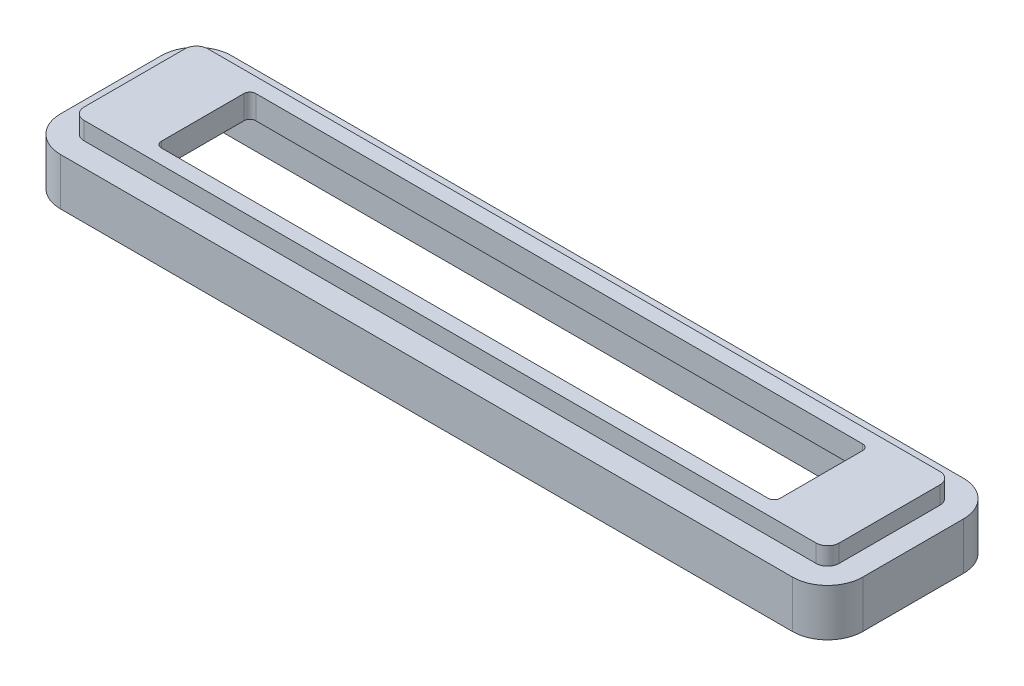
ISO-10303-21;
HEADER;
FILE_DESCRIPTION(('STEP AP214'),'2;1');
FILE_NAME('part.step','',(''),(''),'','','');
FILE_SCHEMA(('AUTOMOTIVE_DESIGN { 1 0 10303 214 1 1 1 1 }'));
ENDSEC;
DATA;
#1=APPLICATION_CONTEXT('core data for automotive mechanical design processes');
#2=APPLICATION_PROTOCOL_DEFINITION('international standard','automotive_design',2000,#1);
#3=PRODUCT_CONTEXT('',#1,'mechanical');
#4=PRODUCT('Part','Part','',(#3));
#5=PRODUCT_RELATED_PRODUCT_CATEGORY('part','',(#4));
#6=PRODUCT_DEFINITION_FORMATION('','',#4);
#7=PRODUCT_DEFINITION_CONTEXT('part definition',#1,'design');
#8=PRODUCT_DEFINITION('design','',#6,#7);
#9=PRODUCT_DEFINITION_SHAPE('','',#8);
#10=(LENGTH_UNIT() NAMED_UNIT(*) SI_UNIT(.MILLI.,.METRE.));
#11=(NAMED_UNIT(*) PLANE_ANGLE_UNIT() SI_UNIT($,.RADIAN.));
#12=(NAMED_UNIT(*) SI_UNIT($,.STERADIAN.) SOLID_ANGLE_UNIT());
#13=UNCERTAINTY_MEASURE_WITH_UNIT(LENGTH_MEASURE(1.E-05),#10,'distance_accuracy_value','');
#14=(GEOMETRIC_REPRESENTATION_CONTEXT(3) GLOBAL_UNCERTAINTY_ASSIGNED_CONTEXT((#13)) GLOBAL_UNIT_ASSIGNED_CONTEXT((#10,
#11,#12)) REPRESENTATION_CONTEXT('',''));
#15=CARTESIAN_POINT('',(0.,0.,0.));
#16=DIRECTION('',(0.,0.,1.));
#17=DIRECTION('',(1.,0.,0.));
#18=AXIS2_PLACEMENT_3D('',#15,#16,#17);
#19=CARTESIAN_POINT('',(31.0185424735563,2.,4.26854247355629));
#20=DIRECTION('',(0.,1.,0.));
#21=DIRECTION('',(0.,0.,1.));
#22=AXIS2_PLACEMENT_3D('',#19,#20,#21);
#23=PLANE('',#22);
#24=CARTESIAN_POINT('',(31.0185424735563,2.,4.26854247355629));
#25=DIRECTION('',(0.,1.,0.));
#26=DIRECTION('',(0.,0.,1.));
#27=AXIS2_PLACEMENT_3D('',#24,#25,#26);
#28=CIRCLE('',#27,0.981457526443713);
#29=CARTESIAN_POINT('',(31.0185424735563,2.,5.25));
#30=VERTEX_POINT('',#29);
#31=CARTESIAN_POINT('',(32.,2.,4.26854247355628));
#32=VERTEX_POINT('',#31);
#33=EDGE_CURVE('E448',#30,#32,#28,.T.);
#34=ORIENTED_EDGE('',*,*,#33,.T.);
#35=DIRECTION('',(0.,0.,-1.));
#36=VECTOR('',#35,1.);
#37=CARTESIAN_POINT('',(32.,2.,4.26854247355628));
#38=LINE('',#37,#36);
#39=CARTESIAN_POINT('',(32.,2.,-4.26854247355628));
#40=VERTEX_POINT('',#39);
#41=EDGE_CURVE('E451',#32,#40,#38,.T.);
#42=ORIENTED_EDGE('',*,*,#41,.T.);
#43=CARTESIAN_POINT('',(31.0185424735563,2.,-4.26854247355629));
#44=DIRECTION('',(0.,1.,0.));
#45=DIRECTION('',(0.,0.,1.));
#46=AXIS2_PLACEMENT_3D('',#43,#44,#45);
#47=CIRCLE('',#46,0.981457526443713);
#48=CARTESIAN_POINT('',(31.0185424735563,2.,-5.25));
#49=VERTEX_POINT('',#48);
#50=EDGE_CURVE('E454',#40,#49,#47,.T.);
#51=ORIENTED_EDGE('',*,*,#50,.T.);
#52=DIRECTION('',(-1.,0.,0.));
#53=VECTOR('',#52,1.);
#54=CARTESIAN_POINT('',(-31.0185424735563,2.,-5.25));
#55=LINE('',#54,#53);
#56=CARTESIAN_POINT('',(-31.0185424735563,2.,-5.25));
#57=VERTEX_POINT('',#56);
#58=EDGE_CURVE('E456',#49,#57,#55,.T.);
#59=ORIENTED_EDGE('',*,*,#58,.T.);
#60=CARTESIAN_POINT('',(-31.0185424735563,2.,-4.26854247355629));
#61=DIRECTION('',(0.,1.,0.));
#62=DIRECTION('',(0.,0.,-1.));
#63=AXIS2_PLACEMENT_3D('',#60,#61,#62);
#64=CIRCLE('',#63,0.981457526443713);
#65=CARTESIAN_POINT('',(-32.,2.,-4.26854247355628));
#66=VERTEX_POINT('',#65);
#67=EDGE_CURVE('E458',#57,#66,#64,.T.);
#68=ORIENTED_EDGE('',*,*,#67,.T.);
#69=DIRECTION('',(0.,0.,1.));
#70=VECTOR('',#69,1.);
#71=CARTESIAN_POINT('',(-32.,2.,4.26854247355628));
#72=LINE('',#71,#70);
#73=CARTESIAN_POINT('',(-32.,2.,4.26854247355628));
#74=VERTEX_POINT('',#73);
#75=EDGE_CURVE('E460',#66,#74,#72,.T.);
#76=ORIENTED_EDGE('',*,*,#75,.T.);
#77=CARTESIAN_POINT('',(-31.0185424735563,2.,4.26854247355629));
#78=DIRECTION('',(0.,1.,0.));
#79=DIRECTION('',(0.,0.,-1.));
#80=AXIS2_PLACEMENT_3D('',#77,#78,#79);
#81=CIRCLE('',#80,0.981457526443713);
#82=CARTESIAN_POINT('',(-31.0185424735563,2.,5.25));
#83=VERTEX_POINT('',#82);
#84=EDGE_CURVE('E462',#74,#83,#81,.T.);
#85=ORIENTED_EDGE('',*,*,#84,.T.);
#86=DIRECTION('',(1.,0.,0.));
#87=VECTOR('',#86,1.);
#88=CARTESIAN_POINT('',(-31.0185424735563,2.,5.25));
#89=LINE('',#88,#87);
#90=EDGE_CURVE('E464',#83,#30,#89,.T.);
#91=ORIENTED_EDGE('',*,*,#90,.T.);
#92=EDGE_LOOP('',(#34,#42,#51,#59,#68,#76,#85,#91));
#93=FACE_BOUND('',#92,.T.);
#94=DIRECTION('',(0.,0.,-1.));
#95=VECTOR('',#94,1.);
#96=CARTESIAN_POINT('',(26.215,2.,-3.50000032024923));
#97=LINE('',#96,#95);
#98=CARTESIAN_POINT('',(26.215,2.,3.50000032024923));
#99=VERTEX_POINT('',#98);
#100=CARTESIAN_POINT('',(26.215,2.,-3.50000032024923));
#101=VERTEX_POINT('',#100);
#102=EDGE_CURVE('E394',#99,#101,#97,.T.);
#103=ORIENTED_EDGE('',*,*,#102,.F.);
#104=CARTESIAN_POINT('',(25.715,2.,3.50000032024924));
#105=DIRECTION('',(0.,1.,0.));
#106=DIRECTION('',(0.,0.,1.));
#107=AXIS2_PLACEMENT_3D('',#104,#105,#106);
#108=CIRCLE('',#107,0.5);
#109=CARTESIAN_POINT('',(25.715,2.,4.00000032024924));
#110=VERTEX_POINT('',#109);
#111=EDGE_CURVE('E392',#110,#99,#108,.T.);
#112=ORIENTED_EDGE('',*,*,#111,.F.);
#113=DIRECTION('',(1.,0.,0.));
#114=VECTOR('',#113,1.);
#115=CARTESIAN_POINT('',(-25.715,2.,4.00000032024924));
#116=LINE('',#115,#114);
#117=CARTESIAN_POINT('',(-25.715,2.,4.00000032024924));
#118=VERTEX_POINT('',#117);
#119=EDGE_CURVE('E407',#118,#110,#116,.T.);
#120=ORIENTED_EDGE('',*,*,#119,.F.);
#121=CARTESIAN_POINT('',(-25.715,2.,3.50000032024924));
#122=DIRECTION('',(0.,1.,0.));
#123=DIRECTION('',(0.,0.,1.));
#124=AXIS2_PLACEMENT_3D('',#121,#122,#123);
#125=CIRCLE('',#124,0.5);
#126=CARTESIAN_POINT('',(-26.215,2.,3.50000032024923));
#127=VERTEX_POINT('',#126);
#128=EDGE_CURVE('E405',#127,#118,#125,.T.);
#129=ORIENTED_EDGE('',*,*,#128,.F.);
#130=DIRECTION('',(0.,0.,1.));
#131=VECTOR('',#130,1.);
#132=CARTESIAN_POINT('',(-26.215,2.,-3.50000032024923));
#133=LINE('',#132,#131);
#134=CARTESIAN_POINT('',(-26.215,2.,-3.50000032024923));
#135=VERTEX_POINT('',#134);
#136=EDGE_CURVE('E403',#135,#127,#133,.T.);
#137=ORIENTED_EDGE('',*,*,#136,.F.);
#138=CARTESIAN_POINT('',(-25.715,2.,-3.50000032024924));
#139=DIRECTION('',(0.,1.,0.));
#140=DIRECTION('',(0.,0.,-1.));
#141=AXIS2_PLACEMENT_3D('',#138,#139,#140);
#142=CIRCLE('',#141,0.5);
#143=CARTESIAN_POINT('',(-25.715,2.,-4.00000032024924));
#144=VERTEX_POINT('',#143);
#145=EDGE_CURVE('E401',#144,#135,#142,.T.);
#146=ORIENTED_EDGE('',*,*,#145,.F.);
#147=DIRECTION('',(-1.,0.,0.));
#148=VECTOR('',#147,1.);
#149=CARTESIAN_POINT('',(-25.715,2.,-4.00000032024924));
#150=LINE('',#149,#148);
#151=CARTESIAN_POINT('',(25.715,2.,-4.00000032024924));
#152=VERTEX_POINT('',#151);
#153=EDGE_CURVE('E399',#152,#144,#150,.T.);
#154=ORIENTED_EDGE('',*,*,#153,.F.);
#155=CARTESIAN_POINT('',(25.715,2.,-3.50000032024924));
#156=DIRECTION('',(0.,1.,0.));
#157=DIRECTION('',(0.,0.,1.));
#158=AXIS2_PLACEMENT_3D('',#155,#156,#157);
#159=CIRCLE('',#158,0.5);
#160=EDGE_CURVE('E397',#101,#152,#159,.T.);
#161=ORIENTED_EDGE('',*,*,#160,.F.);
#162=EDGE_LOOP('',(#103,#112,#120,#129,#137,#146,#154,#161));
#163=FACE_BOUND('',#162,.T.);
#164=ADVANCED_FACE('F37',(#93,#163),#23,.T.);
#165=CARTESIAN_POINT('',(31.0185424735563,0.,4.26854247355629));
#166=DIRECTION('',(0.,1.,0.));
#167=DIRECTION('',(0.,0.,1.));
#168=AXIS2_PLACEMENT_3D('',#165,#166,#167);
#169=PLANE('',#168);
#170=CARTESIAN_POINT('',(31.0185424735563,0.,4.26854247355629));
#171=DIRECTION('',(0.,1.,0.));
#172=DIRECTION('',(0.,0.,1.));
#173=AXIS2_PLACEMENT_3D('',#170,#171,#172);
#174=CIRCLE('',#173,0.981457526443713);
#175=CARTESIAN_POINT('',(31.0185424735563,0.,5.25));
#176=VERTEX_POINT('',#175);
#177=CARTESIAN_POINT('',(32.,0.,4.26854247355628));
#178=VERTEX_POINT('',#177);
#179=EDGE_CURVE('E254',#176,#178,#174,.T.);
#180=ORIENTED_EDGE('',*,*,#179,.F.);
#181=DIRECTION('',(1.,0.,0.));
#182=VECTOR('',#181,1.);
#183=CARTESIAN_POINT('',(-31.0185424735563,0.,5.25));
#184=LINE('',#183,#182);
#185=CARTESIAN_POINT('',(-31.0185424735563,0.,5.25));
#186=VERTEX_POINT('',#185);
#187=EDGE_CURVE('E452',#186,#176,#184,.T.);
#188=ORIENTED_EDGE('',*,*,#187,.F.);
#189=CARTESIAN_POINT('',(-31.0185424735563,0.,4.26854247355629));
#190=DIRECTION('',(0.,1.,0.));
#191=DIRECTION('',(0.,0.,-1.));
#192=AXIS2_PLACEMENT_3D('',#189,#190,#191);
#193=CIRCLE('',#192,0.981457526443713);
#194=CARTESIAN_POINT('',(-32.,0.,4.26854247355628));
#195=VERTEX_POINT('',#194);
#196=EDGE_CURVE('E482',#195,#186,#193,.T.);
#197=ORIENTED_EDGE('',*,*,#196,.F.);
#198=DIRECTION('',(0.,0.,1.));
#199=VECTOR('',#198,1.);
#200=CARTESIAN_POINT('',(-32.,0.,4.26854247355628));
#201=LINE('',#200,#199);
#202=CARTESIAN_POINT('',(-32.,0.,-4.26854247355628));
#203=VERTEX_POINT('',#202);
#204=EDGE_CURVE('E479',#203,#195,#201,.T.);
#205=ORIENTED_EDGE('',*,*,#204,.F.);
#206=CARTESIAN_POINT('',(-31.0185424735563,0.,-4.26854247355629));
#207=DIRECTION('',(0.,1.,0.));
#208=DIRECTION('',(0.,0.,-1.));
#209=AXIS2_PLACEMENT_3D('',#206,#207,#208);
#210=CIRCLE('',#209,0.981457526443713);
#211=CARTESIAN_POINT('',(-31.0185424735563,0.,-5.25));
#212=VERTEX_POINT('',#211);
#213=EDGE_CURVE('E476',#212,#203,#210,.T.);
#214=ORIENTED_EDGE('',*,*,#213,.F.);
#215=DIRECTION('',(-1.,0.,0.));
#216=VECTOR('',#215,1.);
#217=CARTESIAN_POINT('',(-31.0185424735563,0.,-5.25));
#218=LINE('',#217,#216);
#219=CARTESIAN_POINT('',(31.0185424735563,0.,-5.25));
#220=VERTEX_POINT('',#219);
#221=EDGE_CURVE('E473',#220,#212,#218,.T.);
#222=ORIENTED_EDGE('',*,*,#221,.F.);
#223=CARTESIAN_POINT('',(31.0185424735563,0.,-4.26854247355629));
#224=DIRECTION('',(0.,1.,0.));
#225=DIRECTION('',(0.,0.,1.));
#226=AXIS2_PLACEMENT_3D('',#223,#224,#225);
#227=CIRCLE('',#226,0.981457526443713);
#228=CARTESIAN_POINT('',(32.,0.,-4.26854247355628));
#229=VERTEX_POINT('',#228);
#230=EDGE_CURVE('E470',#229,#220,#227,.T.);
#231=ORIENTED_EDGE('',*,*,#230,.F.);
#232=DIRECTION('',(0.,0.,-1.));
#233=VECTOR('',#232,1.);
#234=CARTESIAN_POINT('',(32.,0.,4.26854247355628));
#235=LINE('',#234,#233);
#236=EDGE_CURVE('E468',#178,#229,#235,.T.);
#237=ORIENTED_EDGE('',*,*,#236,.F.);
#238=EDGE_LOOP('',(#180,#188,#197,#205,#214,#222,#231,#237));
#239=FACE_BOUND('',#238,.T.);
#240=CARTESIAN_POINT('',(25.715,0.,3.50000032024924));
#241=DIRECTION('',(0.,1.,0.));
#242=DIRECTION('',(0.,0.,1.));
#243=AXIS2_PLACEMENT_3D('',#240,#241,#242);
#244=CIRCLE('',#243,0.5);
#245=CARTESIAN_POINT('',(25.715,0.,4.00000032024924));
#246=VERTEX_POINT('',#245);
#247=CARTESIAN_POINT('',(26.215,0.,3.50000032024923));
#248=VERTEX_POINT('',#247);
#249=EDGE_CURVE('E378',#246,#248,#244,.T.);
#250=ORIENTED_EDGE('',*,*,#249,.T.);
#251=DIRECTION('',(0.,0.,-1.));
#252=VECTOR('',#251,1.);
#253=CARTESIAN_POINT('',(26.215,0.,-3.50000032024923));
#254=LINE('',#253,#252);
#255=CARTESIAN_POINT('',(26.215,0.,-3.50000032024923));
#256=VERTEX_POINT('',#255);
#257=EDGE_CURVE('E412',#248,#256,#254,.T.);
#258=ORIENTED_EDGE('',*,*,#257,.T.);
#259=CARTESIAN_POINT('',(25.715,0.,-3.50000032024924));
#260=DIRECTION('',(0.,1.,0.));
#261=DIRECTION('',(0.,0.,1.));
#262=AXIS2_PLACEMENT_3D('',#259,#260,#261);
#263=CIRCLE('',#262,0.5);
#264=CARTESIAN_POINT('',(25.715,0.,-4.00000032024924));
#265=VERTEX_POINT('',#264);
#266=EDGE_CURVE('E415',#256,#265,#263,.T.);
#267=ORIENTED_EDGE('',*,*,#266,.T.);
#268=DIRECTION('',(-1.,0.,0.));
#269=VECTOR('',#268,1.);
#270=CARTESIAN_POINT('',(-25.715,0.,-4.00000032024924));
#271=LINE('',#270,#269);
#272=CARTESIAN_POINT('',(-25.715,0.,-4.00000032024924));
#273=VERTEX_POINT('',#272);
#274=EDGE_CURVE('E418',#265,#273,#271,.T.);
#275=ORIENTED_EDGE('',*,*,#274,.T.);
#276=CARTESIAN_POINT('',(-25.715,0.,-3.50000032024924));
#277=DIRECTION('',(0.,1.,0.));
#278=DIRECTION('',(0.,0.,-1.));
#279=AXIS2_PLACEMENT_3D('',#276,#277,#278);
#280=CIRCLE('',#279,0.5);
#281=CARTESIAN_POINT('',(-26.215,0.,-3.50000032024923));
#282=VERTEX_POINT('',#281);
#283=EDGE_CURVE('E421',#273,#282,#280,.T.);
#284=ORIENTED_EDGE('',*,*,#283,.T.);
#285=DIRECTION('',(0.,0.,1.));
#286=VECTOR('',#285,1.);
#287=CARTESIAN_POINT('',(-26.215,0.,-3.50000032024923));
#288=LINE('',#287,#286);
#289=CARTESIAN_POINT('',(-26.215,0.,3.50000032024923));
#290=VERTEX_POINT('',#289);
#291=EDGE_CURVE('E424',#282,#290,#288,.T.);
#292=ORIENTED_EDGE('',*,*,#291,.T.);
#293=CARTESIAN_POINT('',(-25.715,0.,3.50000032024924));
#294=DIRECTION('',(0.,1.,0.));
#295=DIRECTION('',(0.,0.,1.));
#296=AXIS2_PLACEMENT_3D('',#293,#294,#295);
#297=CIRCLE('',#296,0.5);
#298=CARTESIAN_POINT('',(-25.715,0.,4.00000032024924));
#299=VERTEX_POINT('',#298);
#300=EDGE_CURVE('E427',#290,#299,#297,.T.);
#301=ORIENTED_EDGE('',*,*,#300,.T.);
#302=DIRECTION('',(1.,0.,0.));
#303=VECTOR('',#302,1.);
#304=CARTESIAN_POINT('',(-25.715,0.,4.00000032024924));
#305=LINE('',#304,#303);
#306=EDGE_CURVE('E395',#299,#246,#305,.T.);
#307=ORIENTED_EDGE('',*,*,#306,.T.);
#308=EDGE_LOOP('',(#250,#258,#267,#275,#284,#292,#301,#307));
#309=FACE_BOUND('',#308,.T.);
#310=ADVANCED_FACE('F539',(#239,#309),#169,.F.);
#311=CARTESIAN_POINT('',(31.0185424735563,2.,4.26854247355629));
#312=DIRECTION('',(0.,-1.,0.));
#313=DIRECTION('',(0.,0.,-1.));
#314=AXIS2_PLACEMENT_3D('',#311,#312,#313);
#315=CYLINDRICAL_SURFACE('',#314,0.981457526443713);
#316=DIRECTION('',(0.,-1.,0.));
#317=VECTOR('',#316,1.);
#318=CARTESIAN_POINT('',(31.0185424735563,2.,5.25));
#319=LINE('',#318,#317);
#320=CARTESIAN_POINT('',(31.0185424735563,0.5,5.25));
#321=VERTEX_POINT('',#320);
#322=EDGE_CURVE('E466',#30,#321,#319,.T.);
#323=ORIENTED_EDGE('',*,*,#322,.T.);
#324=CARTESIAN_POINT('',(31.0185424735563,0.5,4.26854247355629));
#325=DIRECTION('',(0.,1.,0.));
#326=DIRECTION('',(0.,0.,1.));
#327=AXIS2_PLACEMENT_3D('',#324,#325,#326);
#328=CIRCLE('',#327,0.981457526443713);
#329=CARTESIAN_POINT('',(32.,0.5,4.26854247355629));
#330=VERTEX_POINT('',#329);
#331=EDGE_CURVE('E52',#321,#330,#328,.T.);
#332=ORIENTED_EDGE('',*,*,#331,.T.);
#333=DIRECTION('',(0.,-1.,0.));
#334=VECTOR('',#333,1.);
#335=CARTESIAN_POINT('',(32.,2.,4.26854247355628));
#336=LINE('',#335,#334);
#337=EDGE_CURVE('E11',#32,#330,#336,.T.);
#338=ORIENTED_EDGE('',*,*,#337,.F.);
#339=ORIENTED_EDGE('',*,*,#33,.F.);
#340=EDGE_LOOP('',(#323,#332,#338,#339));
#341=FACE_BOUND('',#340,.T.);
#342=ADVANCED_FACE('F39',(#341),#315,.T.);
#343=CARTESIAN_POINT('',(32.,2.,4.26854247355628));
#344=DIRECTION('',(-1.,0.,0.));
#345=DIRECTION('',(0.,0.,1.));
#346=AXIS2_PLACEMENT_3D('',#343,#344,#345);
#347=PLANE('',#346);
#348=ORIENTED_EDGE('',*,*,#337,.T.);
#349=DIRECTION('',(0.,0.,-1.));
#350=VECTOR('',#349,1.);
#351=CARTESIAN_POINT('',(32.,0.5,4.26854247355629));
#352=LINE('',#351,#350);
#353=CARTESIAN_POINT('',(32.,0.5,-4.26854247355628));
#354=VERTEX_POINT('',#353);
#355=EDGE_CURVE('E292',#330,#354,#352,.T.);
#356=ORIENTED_EDGE('',*,*,#355,.T.);
#357=DIRECTION('',(0.,-1.,0.));
#358=VECTOR('',#357,1.);
#359=CARTESIAN_POINT('',(32.,2.,-4.26854247355628));
#360=LINE('',#359,#358);
#361=EDGE_CURVE('E45',#40,#354,#360,.T.);
#362=ORIENTED_EDGE('',*,*,#361,.F.);
#363=ORIENTED_EDGE('',*,*,#41,.F.);
#364=EDGE_LOOP('',(#348,#356,#362,#363));
#365=FACE_BOUND('',#364,.T.);
#366=ADVANCED_FACE('F510',(#365),#347,.F.);
#367=CARTESIAN_POINT('',(31.0185424735563,2.,-4.26854247355629));
#368=DIRECTION('',(0.,-1.,0.));
#369=DIRECTION('',(0.,0.,-1.));
#370=AXIS2_PLACEMENT_3D('',#367,#368,#369);
#371=CYLINDRICAL_SURFACE('',#370,0.981457526443713);
#372=ORIENTED_EDGE('',*,*,#361,.T.);
#373=CARTESIAN_POINT('',(31.0185424735563,0.5,-4.26854247355629));
#374=DIRECTION('',(0.,1.,0.));
#375=DIRECTION('',(0.,0.,1.));
#376=AXIS2_PLACEMENT_3D('',#373,#374,#375);
#377=CIRCLE('',#376,0.981457526443713);
#378=CARTESIAN_POINT('',(31.0185424735563,0.5,-5.25));
#379=VERTEX_POINT('',#378);
#380=EDGE_CURVE('E295',#354,#379,#377,.T.);
#381=ORIENTED_EDGE('',*,*,#380,.T.);
#382=DIRECTION('',(0.,-1.,0.));
#383=VECTOR('',#382,1.);
#384=CARTESIAN_POINT('',(31.0185424735563,2.,-5.25));
#385=LINE('',#384,#383);
#386=EDGE_CURVE('E501',#49,#379,#385,.T.);
#387=ORIENTED_EDGE('',*,*,#386,.F.);
#388=ORIENTED_EDGE('',*,*,#50,.F.);
#389=EDGE_LOOP('',(#372,#381,#387,#388));
#390=FACE_BOUND('',#389,.T.);
#391=ADVANCED_FACE('F507',(#390),#371,.T.);
#392=CARTESIAN_POINT('',(-31.0185424735563,2.,-5.25));
#393=DIRECTION('',(0.,0.,1.));
#394=DIRECTION('',(1.,0.,0.));
#395=AXIS2_PLACEMENT_3D('',#392,#393,#394);
#396=PLANE('',#395);
#397=ORIENTED_EDGE('',*,*,#386,.T.);
#398=DIRECTION('',(-1.,0.,0.));
#399=VECTOR('',#398,1.);
#400=CARTESIAN_POINT('',(31.0185424735563,0.5,-5.25));
#401=LINE('',#400,#399);
#402=CARTESIAN_POINT('',(-31.0185424735563,0.5,-5.25));
#403=VERTEX_POINT('',#402);
#404=EDGE_CURVE('E298',#379,#403,#401,.T.);
#405=ORIENTED_EDGE('',*,*,#404,.T.);
#406=DIRECTION('',(0.,-1.,0.));
#407=VECTOR('',#406,1.);
#408=CARTESIAN_POINT('',(-31.0185424735563,2.,-5.25));
#409=LINE('',#408,#407);
#410=EDGE_CURVE('E498',#57,#403,#409,.T.);
#411=ORIENTED_EDGE('',*,*,#410,.F.);
#412=ORIENTED_EDGE('',*,*,#58,.F.);
#413=EDGE_LOOP('',(#397,#405,#411,#412));
#414=FACE_BOUND('',#413,.T.);
#415=ADVANCED_FACE('F535',(#414),#396,.F.);
#416=CARTESIAN_POINT('',(-31.0185424735563,2.,-4.26854247355629));
#417=DIRECTION('',(0.,-1.,0.));
#418=DIRECTION('',(0.,0.,-1.));
#419=AXIS2_PLACEMENT_3D('',#416,#417,#418);
#420=CYLINDRICAL_SURFACE('',#419,0.981457526443713);
#421=ORIENTED_EDGE('',*,*,#410,.T.);
#422=CARTESIAN_POINT('',(-31.0185424735563,0.5,-4.26854247355629));
#423=DIRECTION('',(0.,1.,0.));
#424=DIRECTION('',(0.,0.,1.));
#425=AXIS2_PLACEMENT_3D('',#422,#423,#424);
#426=CIRCLE('',#425,0.981457526443713);
#427=CARTESIAN_POINT('',(-32.,0.5,-4.26854247355628));
#428=VERTEX_POINT('',#427);
#429=EDGE_CURVE('E301',#403,#428,#426,.T.);
#430=ORIENTED_EDGE('',*,*,#429,.T.);
#431=DIRECTION('',(0.,-1.,0.));
#432=VECTOR('',#431,1.);
#433=CARTESIAN_POINT('',(-32.,2.,-4.26854247355628));
#434=LINE('',#433,#432);
#435=EDGE_CURVE('E495',#66,#428,#434,.T.);
#436=ORIENTED_EDGE('',*,*,#435,.F.);
#437=ORIENTED_EDGE('',*,*,#67,.F.);
#438=EDGE_LOOP('',(#421,#430,#436,#437));
#439=FACE_BOUND('',#438,.T.);
#440=ADVANCED_FACE('F530',(#439),#420,.T.);
#441=CARTESIAN_POINT('',(-32.,2.,4.26854247355628));
#442=DIRECTION('',(1.,0.,0.));
#443=DIRECTION('',(0.,0.,-1.));
#444=AXIS2_PLACEMENT_3D('',#441,#442,#443);
#445=PLANE('',#444);
#446=ORIENTED_EDGE('',*,*,#435,.T.);
#447=DIRECTION('',(0.,0.,1.));
#448=VECTOR('',#447,1.);
#449=CARTESIAN_POINT('',(-32.,0.5,-4.26854247355628));
#450=LINE('',#449,#448);
#451=CARTESIAN_POINT('',(-32.,0.5,4.26854247355628));
#452=VERTEX_POINT('',#451);
#453=EDGE_CURVE('E304',#428,#452,#450,.T.);
#454=ORIENTED_EDGE('',*,*,#453,.T.);
#455=DIRECTION('',(0.,-1.,0.));
#456=VECTOR('',#455,1.);
#457=CARTESIAN_POINT('',(-32.,2.,4.26854247355628));
#458=LINE('',#457,#456);
#459=EDGE_CURVE('E492',#74,#452,#458,.T.);
#460=ORIENTED_EDGE('',*,*,#459,.F.);
#461=ORIENTED_EDGE('',*,*,#75,.F.);
#462=EDGE_LOOP('',(#446,#454,#460,#461));
#463=FACE_BOUND('',#462,.T.);
#464=ADVANCED_FACE('F527',(#463),#445,.F.);
#465=CARTESIAN_POINT('',(-31.0185424735563,2.,4.26854247355629));
#466=DIRECTION('',(0.,-1.,0.));
#467=DIRECTION('',(0.,0.,-1.));
#468=AXIS2_PLACEMENT_3D('',#465,#466,#467);
#469=CYLINDRICAL_SURFACE('',#468,0.981457526443713);
#470=ORIENTED_EDGE('',*,*,#459,.T.);
#471=CARTESIAN_POINT('',(-31.0185424735563,0.5,4.26854247355629));
#472=DIRECTION('',(0.,1.,0.));
#473=DIRECTION('',(0.,0.,1.));
#474=AXIS2_PLACEMENT_3D('',#471,#472,#473);
#475=CIRCLE('',#474,0.981457526443713);
#476=CARTESIAN_POINT('',(-31.0185424735563,0.5,5.25));
#477=VERTEX_POINT('',#476);
#478=EDGE_CURVE('E275',#452,#477,#475,.T.);
#479=ORIENTED_EDGE('',*,*,#478,.T.);
#480=DIRECTION('',(0.,-1.,0.));
#481=VECTOR('',#480,1.);
#482=CARTESIAN_POINT('',(-31.0185424735563,2.,5.25));
#483=LINE('',#482,#481);
#484=EDGE_CURVE('E489',#83,#477,#483,.T.);
#485=ORIENTED_EDGE('',*,*,#484,.F.);
#486=ORIENTED_EDGE('',*,*,#84,.F.);
#487=EDGE_LOOP('',(#470,#479,#485,#486));
#488=FACE_BOUND('',#487,.T.);
#489=ADVANCED_FACE('F522',(#488),#469,.T.);
#490=CARTESIAN_POINT('',(-31.0185424735563,2.,5.25));
#491=DIRECTION('',(0.,0.,-1.));
#492=DIRECTION('',(-1.,0.,0.));
#493=AXIS2_PLACEMENT_3D('',#490,#491,#492);
#494=PLANE('',#493);
#495=ORIENTED_EDGE('',*,*,#484,.T.);
#496=DIRECTION('',(1.,0.,0.));
#497=VECTOR('',#496,1.);
#498=CARTESIAN_POINT('',(-31.0185424735563,0.5,5.25));
#499=LINE('',#498,#497);
#500=EDGE_CURVE('E273',#477,#321,#499,.T.);
#501=ORIENTED_EDGE('',*,*,#500,.T.);
#502=ORIENTED_EDGE('',*,*,#322,.F.);
#503=ORIENTED_EDGE('',*,*,#90,.F.);
#504=EDGE_LOOP('',(#495,#501,#502,#503));
#505=FACE_BOUND('',#504,.T.);
#506=ADVANCED_FACE('F519',(#505),#494,.F.);
#507=CARTESIAN_POINT('',(25.715,2.,3.50000032024924));
#508=DIRECTION('',(0.,-1.,0.));
#509=DIRECTION('',(0.,0.,-1.));
#510=AXIS2_PLACEMENT_3D('',#507,#508,#509);
#511=CYLINDRICAL_SURFACE('',#510,0.5);
#512=ORIENTED_EDGE('',*,*,#249,.F.);
#513=DIRECTION('',(0.,-1.,0.));
#514=VECTOR('',#513,1.);
#515=CARTESIAN_POINT('',(25.715,2.,4.00000032024924));
#516=LINE('',#515,#514);
#517=EDGE_CURVE('E409',#110,#246,#516,.T.);
#518=ORIENTED_EDGE('',*,*,#517,.F.);
#519=ORIENTED_EDGE('',*,*,#111,.T.);
#520=DIRECTION('',(0.,-1.,0.));
#521=VECTOR('',#520,1.);
#522=CARTESIAN_POINT('',(26.215,2.,3.50000032024923));
#523=LINE('',#522,#521);
#524=EDGE_CURVE('E445',#99,#248,#523,.T.);
#525=ORIENTED_EDGE('',*,*,#524,.T.);
#526=EDGE_LOOP('',(#512,#518,#519,#525));
#527=FACE_BOUND('',#526,.T.);
#528=ADVANCED_FACE('F557',(#527),#511,.F.);
#529=CARTESIAN_POINT('',(26.215,2.,-3.50000032024923));
#530=DIRECTION('',(-1.,0.,0.));
#531=DIRECTION('',(0.,0.,1.));
#532=AXIS2_PLACEMENT_3D('',#529,#530,#531);
#533=PLANE('',#532);
#534=ORIENTED_EDGE('',*,*,#257,.F.);
#535=ORIENTED_EDGE('',*,*,#524,.F.);
#536=ORIENTED_EDGE('',*,*,#102,.T.);
#537=DIRECTION('',(0.,-1.,0.));
#538=VECTOR('',#537,1.);
#539=CARTESIAN_POINT('',(26.215,2.,-3.50000032024923));
#540=LINE('',#539,#538);
#541=EDGE_CURVE('E443',#101,#256,#540,.T.);
#542=ORIENTED_EDGE('',*,*,#541,.T.);
#543=EDGE_LOOP('',(#534,#535,#536,#542));
#544=FACE_BOUND('',#543,.T.);
#545=ADVANCED_FACE('F549',(#544),#533,.T.);
#546=CARTESIAN_POINT('',(25.715,2.,-3.50000032024924));
#547=DIRECTION('',(0.,-1.,0.));
#548=DIRECTION('',(0.,0.,-1.));
#549=AXIS2_PLACEMENT_3D('',#546,#547,#548);
#550=CYLINDRICAL_SURFACE('',#549,0.5);
#551=ORIENTED_EDGE('',*,*,#266,.F.);
#552=ORIENTED_EDGE('',*,*,#541,.F.);
#553=ORIENTED_EDGE('',*,*,#160,.T.);
#554=DIRECTION('',(0.,-1.,0.));
#555=VECTOR('',#554,1.);
#556=CARTESIAN_POINT('',(25.715,2.,-4.00000032024924));
#557=LINE('',#556,#555);
#558=EDGE_CURVE('E441',#152,#265,#557,.T.);
#559=ORIENTED_EDGE('',*,*,#558,.T.);
#560=EDGE_LOOP('',(#551,#552,#553,#559));
#561=FACE_BOUND('',#560,.T.);
#562=ADVANCED_FACE('F552',(#561),#550,.F.);
#563=CARTESIAN_POINT('',(-25.715,2.,-4.00000032024924));
#564=DIRECTION('',(0.,0.,1.));
#565=DIRECTION('',(1.,0.,0.));
#566=AXIS2_PLACEMENT_3D('',#563,#564,#565);
#567=PLANE('',#566);
#568=ORIENTED_EDGE('',*,*,#274,.F.);
#569=ORIENTED_EDGE('',*,*,#558,.F.);
#570=ORIENTED_EDGE('',*,*,#153,.T.);
#571=DIRECTION('',(0.,-1.,0.));
#572=VECTOR('',#571,1.);
#573=CARTESIAN_POINT('',(-25.715,2.,-4.00000032024924));
#574=LINE('',#573,#572);
#575=EDGE_CURVE('E439',#144,#273,#574,.T.);
#576=ORIENTED_EDGE('',*,*,#575,.T.);
#577=EDGE_LOOP('',(#568,#569,#570,#576));
#578=FACE_BOUND('',#577,.T.);
#579=ADVANCED_FACE('F576',(#578),#567,.T.);
#580=CARTESIAN_POINT('',(-25.715,2.,-3.50000032024924));
#581=DIRECTION('',(0.,-1.,0.));
#582=DIRECTION('',(0.,0.,-1.));
#583=AXIS2_PLACEMENT_3D('',#580,#581,#582);
#584=CYLINDRICAL_SURFACE('',#583,0.5);
#585=ORIENTED_EDGE('',*,*,#283,.F.);
#586=ORIENTED_EDGE('',*,*,#575,.F.);
#587=ORIENTED_EDGE('',*,*,#145,.T.);
#588=DIRECTION('',(0.,-1.,0.));
#589=VECTOR('',#588,1.);
#590=CARTESIAN_POINT('',(-26.215,2.,-3.50000032024923));
#591=LINE('',#590,#589);
#592=EDGE_CURVE('E437',#135,#282,#591,.T.);
#593=ORIENTED_EDGE('',*,*,#592,.T.);
#594=EDGE_LOOP('',(#585,#586,#587,#593));
#595=FACE_BOUND('',#594,.T.);
#596=ADVANCED_FACE('F573',(#595),#584,.F.);
#597=CARTESIAN_POINT('',(-26.215,2.,-3.50000032024923));
#598=DIRECTION('',(1.,0.,0.));
#599=DIRECTION('',(0.,0.,-1.));
#600=AXIS2_PLACEMENT_3D('',#597,#598,#599);
#601=PLANE('',#600);
#602=ORIENTED_EDGE('',*,*,#291,.F.);
#603=ORIENTED_EDGE('',*,*,#592,.F.);
#604=ORIENTED_EDGE('',*,*,#136,.T.);
#605=DIRECTION('',(0.,-1.,0.));
#606=VECTOR('',#605,1.);
#607=CARTESIAN_POINT('',(-26.215,2.,3.50000032024923));
#608=LINE('',#607,#606);
#609=EDGE_CURVE('E435',#127,#290,#608,.T.);
#610=ORIENTED_EDGE('',*,*,#609,.T.);
#611=EDGE_LOOP('',(#602,#603,#604,#610));
#612=FACE_BOUND('',#611,.T.);
#613=ADVANCED_FACE('F570',(#612),#601,.T.);
#614=CARTESIAN_POINT('',(-25.715,2.,3.50000032024924));
#615=DIRECTION('',(0.,-1.,0.));
#616=DIRECTION('',(0.,0.,-1.));
#617=AXIS2_PLACEMENT_3D('',#614,#615,#616);
#618=CYLINDRICAL_SURFACE('',#617,0.5);
#619=ORIENTED_EDGE('',*,*,#300,.F.);
#620=ORIENTED_EDGE('',*,*,#609,.F.);
#621=ORIENTED_EDGE('',*,*,#128,.T.);
#622=DIRECTION('',(0.,-1.,0.));
#623=VECTOR('',#622,1.);
#624=CARTESIAN_POINT('',(-25.715,2.,4.00000032024924));
#625=LINE('',#624,#623);
#626=EDGE_CURVE('E60',#118,#299,#625,.T.);
#627=ORIENTED_EDGE('',*,*,#626,.T.);
#628=EDGE_LOOP('',(#619,#620,#621,#627));
#629=FACE_BOUND('',#628,.T.);
#630=ADVANCED_FACE('F564',(#629),#618,.F.);
#631=CARTESIAN_POINT('',(-25.715,2.,4.00000032024924));
#632=DIRECTION('',(0.,0.,-1.));
#633=DIRECTION('',(-1.,0.,0.));
#634=AXIS2_PLACEMENT_3D('',#631,#632,#633);
#635=PLANE('',#634);
#636=ORIENTED_EDGE('',*,*,#306,.F.);
#637=ORIENTED_EDGE('',*,*,#626,.F.);
#638=ORIENTED_EDGE('',*,*,#119,.T.);
#639=ORIENTED_EDGE('',*,*,#517,.T.);
#640=EDGE_LOOP('',(#636,#637,#638,#639));
#641=FACE_BOUND('',#640,.T.);
#642=ADVANCED_FACE('F559',(#641),#635,.T.);
#643=CARTESIAN_POINT('',(32.,-3.5,4.26854247355629));
#644=DIRECTION('',(1.,0.,0.));
#645=DIRECTION('',(0.,0.,-1.));
#646=AXIS2_PLACEMENT_3D('',#643,#644,#645);
#647=PLANE('',#646);
#648=DIRECTION('',(0.,1.,0.));
#649=VECTOR('',#648,1.);
#650=CARTESIAN_POINT('',(32.,-3.5,4.26854247355629));
#651=LINE('',#650,#649);
#652=CARTESIAN_POINT('',(32.,-3.5,4.26854247355629));
#653=VERTEX_POINT('',#652);
#654=EDGE_CURVE('E247',#653,#178,#651,.T.);
#655=ORIENTED_EDGE('',*,*,#654,.T.);
#656=ORIENTED_EDGE('',*,*,#236,.T.);
#657=DIRECTION('',(0.,1.,0.));
#658=VECTOR('',#657,1.);
#659=CARTESIAN_POINT('',(32.,-3.5,-4.26854247355628));
#660=LINE('',#659,#658);
#661=CARTESIAN_POINT('',(32.,-3.5,-4.26854247355628));
#662=VERTEX_POINT('',#661);
#663=EDGE_CURVE('E257',#662,#229,#660,.T.);
#664=ORIENTED_EDGE('',*,*,#663,.F.);
#665=DIRECTION('',(0.,0.,-1.));
#666=VECTOR('',#665,1.);
#667=CARTESIAN_POINT('',(32.,-3.5,4.26854247355629));
#668=LINE('',#667,#666);
#669=EDGE_CURVE('E262',#653,#662,#668,.T.);
#670=ORIENTED_EDGE('',*,*,#669,.F.);
#671=EDGE_LOOP('',(#655,#656,#664,#670));
#672=FACE_BOUND('',#671,.T.);
#673=ADVANCED_FACE('F263',(#672),#647,.F.);
#674=CARTESIAN_POINT('',(31.0185424735563,-3.5,-4.26854247355629));
#675=DIRECTION('',(0.,1.,0.));
#676=DIRECTION('',(0.,0.,1.));
#677=AXIS2_PLACEMENT_3D('',#674,#675,#676);
#678=CYLINDRICAL_SURFACE('',#677,0.981457526443713);
#679=ORIENTED_EDGE('',*,*,#663,.T.);
#680=ORIENTED_EDGE('',*,*,#230,.T.);
#681=DIRECTION('',(0.,1.,0.));
#682=VECTOR('',#681,1.);
#683=CARTESIAN_POINT('',(31.0185424735563,-3.5,-5.25));
#684=LINE('',#683,#682);
#685=CARTESIAN_POINT('',(31.0185424735563,-3.5,-5.25));
#686=VERTEX_POINT('',#685);
#687=EDGE_CURVE('E324',#686,#220,#684,.T.);
#688=ORIENTED_EDGE('',*,*,#687,.F.);
#689=CARTESIAN_POINT('',(31.0185424735563,-3.5,-4.26854247355629));
#690=DIRECTION('',(0.,1.,0.));
#691=DIRECTION('',(0.,0.,1.));
#692=AXIS2_PLACEMENT_3D('',#689,#690,#691);
#693=CIRCLE('',#692,0.981457526443713);
#694=EDGE_CURVE('E267',#662,#686,#693,.T.);
#695=ORIENTED_EDGE('',*,*,#694,.F.);
#696=EDGE_LOOP('',(#679,#680,#688,#695));
#697=FACE_BOUND('',#696,.T.);
#698=ADVANCED_FACE('F680',(#697),#678,.F.);
#699=CARTESIAN_POINT('',(31.0185424735563,-3.5,-5.25));
#700=DIRECTION('',(0.,0.,-1.));
#701=DIRECTION('',(-1.,0.,0.));
#702=AXIS2_PLACEMENT_3D('',#699,#700,#701);
#703=PLANE('',#702);
#704=ORIENTED_EDGE('',*,*,#687,.T.);
#705=ORIENTED_EDGE('',*,*,#221,.T.);
#706=DIRECTION('',(0.,1.,0.));
#707=VECTOR('',#706,1.);
#708=CARTESIAN_POINT('',(-31.0185424735563,-3.5,-5.25));
#709=LINE('',#708,#707);
#710=CARTESIAN_POINT('',(-31.0185424735563,-3.5,-5.25));
#711=VERTEX_POINT('',#710);
#712=EDGE_CURVE('E321',#711,#212,#709,.T.);
#713=ORIENTED_EDGE('',*,*,#712,.F.);
#714=DIRECTION('',(-1.,0.,0.));
#715=VECTOR('',#714,1.);
#716=CARTESIAN_POINT('',(31.0185424735563,-3.5,-5.25));
#717=LINE('',#716,#715);
#718=EDGE_CURVE('E279',#686,#711,#717,.T.);
#719=ORIENTED_EDGE('',*,*,#718,.F.);
#720=EDGE_LOOP('',(#704,#705,#713,#719));
#721=FACE_BOUND('',#720,.T.);
#722=ADVANCED_FACE('F687',(#721),#703,.F.);
#723=CARTESIAN_POINT('',(-31.0185424735563,-3.5,-4.26854247355629));
#724=DIRECTION('',(0.,1.,0.));
#725=DIRECTION('',(0.,0.,1.));
#726=AXIS2_PLACEMENT_3D('',#723,#724,#725);
#727=CYLINDRICAL_SURFACE('',#726,0.981457526443713);
#728=ORIENTED_EDGE('',*,*,#712,.T.);
#729=ORIENTED_EDGE('',*,*,#213,.T.);
#730=DIRECTION('',(0.,1.,0.));
#731=VECTOR('',#730,1.);
#732=CARTESIAN_POINT('',(-32.,-3.5,-4.26854247355628));
#733=LINE('',#732,#731);
#734=CARTESIAN_POINT('',(-32.,-3.5,-4.26854247355628));
#735=VERTEX_POINT('',#734);
#736=EDGE_CURVE('E318',#735,#203,#733,.T.);
#737=ORIENTED_EDGE('',*,*,#736,.F.);
#738=CARTESIAN_POINT('',(-31.0185424735563,-3.5,-4.26854247355629));
#739=DIRECTION('',(0.,1.,0.));
#740=DIRECTION('',(0.,0.,1.));
#741=AXIS2_PLACEMENT_3D('',#738,#739,#740);
#742=CIRCLE('',#741,0.981457526443713);
#743=EDGE_CURVE('E282',#711,#735,#742,.T.);
#744=ORIENTED_EDGE('',*,*,#743,.F.);
#745=EDGE_LOOP('',(#728,#729,#737,#744));
#746=FACE_BOUND('',#745,.T.);
#747=ADVANCED_FACE('F695',(#746),#727,.F.);
#748=CARTESIAN_POINT('',(-31.0185424735563,-3.5,5.25));
#749=DIRECTION('',(0.,0.,1.));
#750=DIRECTION('',(1.,0.,0.));
#751=AXIS2_PLACEMENT_3D('',#748,#749,#750);
#752=PLANE('',#751);
#753=DIRECTION('',(0.,1.,0.));
#754=VECTOR('',#753,1.);
#755=CARTESIAN_POINT('',(-31.0185424735563,-3.5,5.25));
#756=LINE('',#755,#754);
#757=CARTESIAN_POINT('',(-31.0185424735563,-3.5,5.25));
#758=VERTEX_POINT('',#757);
#759=EDGE_CURVE('E312',#758,#186,#756,.T.);
#760=ORIENTED_EDGE('',*,*,#759,.T.);
#761=ORIENTED_EDGE('',*,*,#187,.T.);
#762=DIRECTION('',(0.,1.,0.));
#763=VECTOR('',#762,1.);
#764=CARTESIAN_POINT('',(31.0185424735563,-3.5,5.25));
#765=LINE('',#764,#763);
#766=CARTESIAN_POINT('',(31.0185424735563,-3.5,5.25));
#767=VERTEX_POINT('',#766);
#768=EDGE_CURVE('E309',#767,#176,#765,.T.);
#769=ORIENTED_EDGE('',*,*,#768,.F.);
#770=DIRECTION('',(1.,0.,0.));
#771=VECTOR('',#770,1.);
#772=CARTESIAN_POINT('',(-31.0185424735563,-3.5,5.25));
#773=LINE('',#772,#771);
#774=EDGE_CURVE('E258',#758,#767,#773,.T.);
#775=ORIENTED_EDGE('',*,*,#774,.F.);
#776=EDGE_LOOP('',(#760,#761,#769,#775));
#777=FACE_BOUND('',#776,.T.);
#778=ADVANCED_FACE('F703',(#777),#752,.F.);
#779=CARTESIAN_POINT('',(-32.,-3.5,-4.26854247355628));
#780=DIRECTION('',(-1.,0.,0.));
#781=DIRECTION('',(0.,0.,1.));
#782=AXIS2_PLACEMENT_3D('',#779,#780,#781);
#783=PLANE('',#782);
#784=ORIENTED_EDGE('',*,*,#736,.T.);
#785=ORIENTED_EDGE('',*,*,#204,.T.);
#786=DIRECTION('',(0.,1.,0.));
#787=VECTOR('',#786,1.);
#788=CARTESIAN_POINT('',(-32.,-3.5,4.26854247355628));
#789=LINE('',#788,#787);
#790=CARTESIAN_POINT('',(-32.,-3.5,4.26854247355628));
#791=VERTEX_POINT('',#790);
#792=EDGE_CURVE('E315',#791,#195,#789,.T.);
#793=ORIENTED_EDGE('',*,*,#792,.F.);
#794=DIRECTION('',(0.,0.,1.));
#795=VECTOR('',#794,1.);
#796=CARTESIAN_POINT('',(-32.,-3.5,-4.26854247355628));
#797=LINE('',#796,#795);
#798=EDGE_CURVE('E285',#735,#791,#797,.T.);
#799=ORIENTED_EDGE('',*,*,#798,.F.);
#800=EDGE_LOOP('',(#784,#785,#793,#799));
#801=FACE_BOUND('',#800,.T.);
#802=ADVANCED_FACE('F711',(#801),#783,.F.);
#803=CARTESIAN_POINT('',(31.0185424735563,-3.5,4.26854247355629));
#804=DIRECTION('',(0.,1.,0.));
#805=DIRECTION('',(0.,0.,1.));
#806=AXIS2_PLACEMENT_3D('',#803,#804,#805);
#807=CYLINDRICAL_SURFACE('',#806,0.981457526443713);
#808=ORIENTED_EDGE('',*,*,#768,.T.);
#809=ORIENTED_EDGE('',*,*,#179,.T.);
#810=ORIENTED_EDGE('',*,*,#654,.F.);
#811=CARTESIAN_POINT('',(31.0185424735563,-3.5,4.26854247355629));
#812=DIRECTION('',(0.,1.,0.));
#813=DIRECTION('',(0.,0.,1.));
#814=AXIS2_PLACEMENT_3D('',#811,#812,#813);
#815=CIRCLE('',#814,0.981457526443713);
#816=EDGE_CURVE('E252',#767,#653,#815,.T.);
#817=ORIENTED_EDGE('',*,*,#816,.F.);
#818=EDGE_LOOP('',(#808,#809,#810,#817));
#819=FACE_BOUND('',#818,.T.);
#820=ADVANCED_FACE('F250',(#819),#807,.F.);
#821=CARTESIAN_POINT('',(-31.0185424735563,-3.5,4.26854247355629));
#822=DIRECTION('',(0.,1.,0.));
#823=DIRECTION('',(0.,0.,1.));
#824=AXIS2_PLACEMENT_3D('',#821,#822,#823);
#825=CYLINDRICAL_SURFACE('',#824,0.981457526443713);
#826=ORIENTED_EDGE('',*,*,#792,.T.);
#827=ORIENTED_EDGE('',*,*,#196,.T.);
#828=ORIENTED_EDGE('',*,*,#759,.F.);
#829=CARTESIAN_POINT('',(-31.0185424735563,-3.5,4.26854247355629));
#830=DIRECTION('',(0.,1.,0.));
#831=DIRECTION('',(0.,0.,1.));
#832=AXIS2_PLACEMENT_3D('',#829,#830,#831);
#833=CIRCLE('',#832,0.981457526443713);
#834=EDGE_CURVE('E288',#791,#758,#833,.T.);
#835=ORIENTED_EDGE('',*,*,#834,.F.);
#836=EDGE_LOOP('',(#826,#827,#828,#835));
#837=FACE_BOUND('',#836,.T.);
#838=ADVANCED_FACE('F726',(#837),#825,.F.);
#839=CARTESIAN_POINT('',(-31.0185424735563,-3.5,4.26854247355629));
#840=DIRECTION('',(0.,1.,0.));
#841=DIRECTION('',(0.,0.,1.));
#842=AXIS2_PLACEMENT_3D('',#839,#840,#841);
#843=CYLINDRICAL_SURFACE('',#842,2.98145752644371);
#844=CARTESIAN_POINT('',(-31.0185424735563,0.5,4.26854247355629));
#845=DIRECTION('',(0.,1.,0.));
#846=DIRECTION('',(0.,0.,1.));
#847=AXIS2_PLACEMENT_3D('',#844,#845,#846);
#848=CIRCLE('',#847,2.98145752644371);
#849=CARTESIAN_POINT('',(-34.,0.5,4.26854247355628));
#850=VERTEX_POINT('',#849);
#851=CARTESIAN_POINT('',(-31.0185424735563,0.5,7.25));
#852=VERTEX_POINT('',#851);
#853=EDGE_CURVE('E311',#850,#852,#848,.T.);
#854=ORIENTED_EDGE('',*,*,#853,.F.);
#855=DIRECTION('',(0.,1.,0.));
#856=VECTOR('',#855,1.);
#857=CARTESIAN_POINT('',(-34.,-3.5,4.26854247355628));
#858=LINE('',#857,#856);
#859=CARTESIAN_POINT('',(-34.,-3.5,4.26854247355628));
#860=VERTEX_POINT('',#859);
#861=EDGE_CURVE('E376',#860,#850,#858,.T.);
#862=ORIENTED_EDGE('',*,*,#861,.F.);
#863=CARTESIAN_POINT('',(-31.0185424735563,-3.5,4.26854247355629));
#864=DIRECTION('',(0.,1.,0.));
#865=DIRECTION('',(0.,0.,1.));
#866=AXIS2_PLACEMENT_3D('',#863,#864,#865);
#867=CIRCLE('',#866,2.98145752644371);
#868=CARTESIAN_POINT('',(-31.0185424735563,-3.5,7.25));
#869=VERTEX_POINT('',#868);
#870=EDGE_CURVE('E328',#860,#869,#867,.T.);
#871=ORIENTED_EDGE('',*,*,#870,.T.);
#872=DIRECTION('',(0.,1.,0.));
#873=VECTOR('',#872,1.);
#874=CARTESIAN_POINT('',(-31.0185424735563,-3.5,7.25));
#875=LINE('',#874,#873);
#876=EDGE_CURVE('E353',#869,#852,#875,.T.);
#877=ORIENTED_EDGE('',*,*,#876,.T.);
#878=EDGE_LOOP('',(#854,#862,#871,#877));
#879=FACE_BOUND('',#878,.T.);
#880=ADVANCED_FACE('F733',(#879),#843,.T.);
#881=CARTESIAN_POINT('',(-34.,-3.5,-4.26854247355627));
#882=DIRECTION('',(-1.,0.,0.));
#883=DIRECTION('',(0.,0.,1.));
#884=AXIS2_PLACEMENT_3D('',#881,#882,#883);
#885=PLANE('',#884);
#886=DIRECTION('',(0.,0.,1.));
#887=VECTOR('',#886,1.);
#888=CARTESIAN_POINT('',(-34.,0.5,-4.26854247355627));
#889=LINE('',#888,#887);
#890=CARTESIAN_POINT('',(-34.,0.5,-4.26854247355627));
#891=VERTEX_POINT('',#890);
#892=EDGE_CURVE('E332',#891,#850,#889,.T.);
#893=ORIENTED_EDGE('',*,*,#892,.F.);
#894=DIRECTION('',(0.,1.,0.));
#895=VECTOR('',#894,1.);
#896=CARTESIAN_POINT('',(-34.,-3.5,-4.26854247355627));
#897=LINE('',#896,#895);
#898=CARTESIAN_POINT('',(-34.,-3.5,-4.26854247355627));
#899=VERTEX_POINT('',#898);
#900=EDGE_CURVE('E379',#899,#891,#897,.T.);
#901=ORIENTED_EDGE('',*,*,#900,.F.);
#902=DIRECTION('',(0.,0.,1.));
#903=VECTOR('',#902,1.);
#904=CARTESIAN_POINT('',(-34.,-3.5,-4.26854247355627));
#905=LINE('',#904,#903);
#906=EDGE_CURVE('E350',#899,#860,#905,.T.);
#907=ORIENTED_EDGE('',*,*,#906,.T.);
#908=ORIENTED_EDGE('',*,*,#861,.T.);
#909=EDGE_LOOP('',(#893,#901,#907,#908));
#910=FACE_BOUND('',#909,.T.);
#911=ADVANCED_FACE('F741',(#910),#885,.T.);
#912=CARTESIAN_POINT('',(-31.0185424735563,-3.5,-4.26854247355629));
#913=DIRECTION('',(0.,1.,0.));
#914=DIRECTION('',(0.,0.,1.));
#915=AXIS2_PLACEMENT_3D('',#912,#913,#914);
#916=CYLINDRICAL_SURFACE('',#915,2.98145752644371);
#917=CARTESIAN_POINT('',(-31.0185424735563,0.5,-4.26854247355629));
#918=DIRECTION('',(0.,1.,0.));
#919=DIRECTION('',(0.,0.,1.));
#920=AXIS2_PLACEMENT_3D('',#917,#918,#919);
#921=CIRCLE('',#920,2.98145752644371);
#922=CARTESIAN_POINT('',(-31.0185424735563,0.5,-7.25));
#923=VERTEX_POINT('',#922);
#924=EDGE_CURVE('E371',#923,#891,#921,.T.);
#925=ORIENTED_EDGE('',*,*,#924,.F.);
#926=DIRECTION('',(0.,1.,0.));
#927=VECTOR('',#926,1.);
#928=CARTESIAN_POINT('',(-31.0185424735563,-3.5,-7.25));
#929=LINE('',#928,#927);
#930=CARTESIAN_POINT('',(-31.0185424735563,-3.5,-7.25));
#931=VERTEX_POINT('',#930);
#932=EDGE_CURVE('E381',#931,#923,#929,.T.);
#933=ORIENTED_EDGE('',*,*,#932,.F.);
#934=CARTESIAN_POINT('',(-31.0185424735563,-3.5,-4.26854247355629));
#935=DIRECTION('',(0.,1.,0.));
#936=DIRECTION('',(0.,0.,1.));
#937=AXIS2_PLACEMENT_3D('',#934,#935,#936);
#938=CIRCLE('',#937,2.98145752644371);
#939=EDGE_CURVE('E347',#931,#899,#938,.T.);
#940=ORIENTED_EDGE('',*,*,#939,.T.);
#941=ORIENTED_EDGE('',*,*,#900,.T.);
#942=EDGE_LOOP('',(#925,#933,#940,#941));
#943=FACE_BOUND('',#942,.T.);
#944=ADVANCED_FACE('F749',(#943),#916,.T.);
#945=CARTESIAN_POINT('',(31.0185424735563,-3.5,-7.25));
#946=DIRECTION('',(0.,0.,-1.));
#947=DIRECTION('',(-1.,0.,0.));
#948=AXIS2_PLACEMENT_3D('',#945,#946,#947);
#949=PLANE('',#948);
#950=DIRECTION('',(-1.,0.,0.));
#951=VECTOR('',#950,1.);
#952=CARTESIAN_POINT('',(31.0185424735563,0.5,-7.25));
#953=LINE('',#952,#951);
#954=CARTESIAN_POINT('',(31.0185424735563,0.5,-7.25));
#955=VERTEX_POINT('',#954);
#956=EDGE_CURVE('E368',#955,#923,#953,.T.);
#957=ORIENTED_EDGE('',*,*,#956,.F.);
#958=DIRECTION('',(0.,1.,0.));
#959=VECTOR('',#958,1.);
#960=CARTESIAN_POINT('',(31.0185424735563,-3.5,-7.25));
#961=LINE('',#960,#959);
#962=CARTESIAN_POINT('',(31.0185424735563,-3.5,-7.25));
#963=VERTEX_POINT('',#962);
#964=EDGE_CURVE('E383',#963,#955,#961,.T.);
#965=ORIENTED_EDGE('',*,*,#964,.F.);
#966=DIRECTION('',(-1.,0.,0.));
#967=VECTOR('',#966,1.);
#968=CARTESIAN_POINT('',(31.0185424735563,-3.5,-7.25));
#969=LINE('',#968,#967);
#970=EDGE_CURVE('E344',#963,#931,#969,.T.);
#971=ORIENTED_EDGE('',*,*,#970,.T.);
#972=ORIENTED_EDGE('',*,*,#932,.T.);
#973=EDGE_LOOP('',(#957,#965,#971,#972));
#974=FACE_BOUND('',#973,.T.);
#975=ADVANCED_FACE('F757',(#974),#949,.T.);
#976=CARTESIAN_POINT('',(31.0185424735563,-3.5,-4.26854247355629));
#977=DIRECTION('',(0.,1.,0.));
#978=DIRECTION('',(0.,0.,1.));
#979=AXIS2_PLACEMENT_3D('',#976,#977,#978);
#980=CYLINDRICAL_SURFACE('',#979,2.98145752644371);
#981=CARTESIAN_POINT('',(31.0185424735563,0.5,-4.26854247355629));
#982=DIRECTION('',(0.,1.,0.));
#983=DIRECTION('',(0.,0.,1.));
#984=AXIS2_PLACEMENT_3D('',#981,#982,#983);
#985=CIRCLE('',#984,2.98145752644371);
#986=CARTESIAN_POINT('',(34.,0.5,-4.26854247355628));
#987=VERTEX_POINT('',#986);
#988=EDGE_CURVE('E365',#987,#955,#985,.T.);
#989=ORIENTED_EDGE('',*,*,#988,.F.);
#990=DIRECTION('',(0.,1.,0.));
#991=VECTOR('',#990,1.);
#992=CARTESIAN_POINT('',(34.,-3.5,-4.26854247355628));
#993=LINE('',#992,#991);
#994=CARTESIAN_POINT('',(34.,-3.5,-4.26854247355628));
#995=VERTEX_POINT('',#994);
#996=EDGE_CURVE('E385',#995,#987,#993,.T.);
#997=ORIENTED_EDGE('',*,*,#996,.F.);
#998=CARTESIAN_POINT('',(31.0185424735563,-3.5,-4.26854247355629));
#999=DIRECTION('',(0.,1.,0.));
#1000=DIRECTION('',(0.,0.,1.));
#1001=AXIS2_PLACEMENT_3D('',#998,#999,#1000);
#1002=CIRCLE('',#1001,2.98145752644371);
#1003=EDGE_CURVE('E341',#995,#963,#1002,.T.);
#1004=ORIENTED_EDGE('',*,*,#1003,.T.);
#1005=ORIENTED_EDGE('',*,*,#964,.T.);
#1006=EDGE_LOOP('',(#989,#997,#1004,#1005));
#1007=FACE_BOUND('',#1006,.T.);
#1008=ADVANCED_FACE('F765',(#1007),#980,.T.);
#1009=CARTESIAN_POINT('',(34.,-3.5,4.26854247355627));
#1010=DIRECTION('',(1.,0.,0.));
#1011=DIRECTION('',(0.,0.,-1.));
#1012=AXIS2_PLACEMENT_3D('',#1009,#1010,#1011);
#1013=PLANE('',#1012);
#1014=DIRECTION('',(0.,0.,-1.));
#1015=VECTOR('',#1014,1.);
#1016=CARTESIAN_POINT('',(34.,0.5,4.26854247355627));
#1017=LINE('',#1016,#1015);
#1018=CARTESIAN_POINT('',(34.,0.5,4.26854247355627));
#1019=VERTEX_POINT('',#1018);
#1020=EDGE_CURVE('E362',#1019,#987,#1017,.T.);
#1021=ORIENTED_EDGE('',*,*,#1020,.F.);
#1022=DIRECTION('',(0.,1.,0.));
#1023=VECTOR('',#1022,1.);
#1024=CARTESIAN_POINT('',(34.,-3.5,4.26854247355627));
#1025=LINE('',#1024,#1023);
#1026=CARTESIAN_POINT('',(34.,-3.5,4.26854247355627));
#1027=VERTEX_POINT('',#1026);
#1028=EDGE_CURVE('E387',#1027,#1019,#1025,.T.);
#1029=ORIENTED_EDGE('',*,*,#1028,.F.);
#1030=DIRECTION('',(0.,0.,-1.));
#1031=VECTOR('',#1030,1.);
#1032=CARTESIAN_POINT('',(34.,-3.5,4.26854247355627));
#1033=LINE('',#1032,#1031);
#1034=EDGE_CURVE('E338',#1027,#995,#1033,.T.);
#1035=ORIENTED_EDGE('',*,*,#1034,.T.);
#1036=ORIENTED_EDGE('',*,*,#996,.T.);
#1037=EDGE_LOOP('',(#1021,#1029,#1035,#1036));
#1038=FACE_BOUND('',#1037,.T.);
#1039=ADVANCED_FACE('F773',(#1038),#1013,.T.);
#1040=CARTESIAN_POINT('',(31.0185424735563,-3.5,4.26854247355629));
#1041=DIRECTION('',(0.,1.,0.));
#1042=DIRECTION('',(0.,0.,1.));
#1043=AXIS2_PLACEMENT_3D('',#1040,#1041,#1042);
#1044=CYLINDRICAL_SURFACE('',#1043,2.98145752644371);
#1045=CARTESIAN_POINT('',(31.0185424735563,0.5,4.26854247355629));
#1046=DIRECTION('',(0.,1.,0.));
#1047=DIRECTION('',(0.,0.,1.));
#1048=AXIS2_PLACEMENT_3D('',#1045,#1046,#1047);
#1049=CIRCLE('',#1048,2.98145752644371);
#1050=CARTESIAN_POINT('',(31.0185424735563,0.5,7.25));
#1051=VERTEX_POINT('',#1050);
#1052=EDGE_CURVE('E359',#1051,#1019,#1049,.T.);
#1053=ORIENTED_EDGE('',*,*,#1052,.F.);
#1054=DIRECTION('',(0.,1.,0.));
#1055=VECTOR('',#1054,1.);
#1056=CARTESIAN_POINT('',(31.0185424735563,-3.5,7.25));
#1057=LINE('',#1056,#1055);
#1058=CARTESIAN_POINT('',(31.0185424735563,-3.5,7.25));
#1059=VERTEX_POINT('',#1058);
#1060=EDGE_CURVE('E389',#1059,#1051,#1057,.T.);
#1061=ORIENTED_EDGE('',*,*,#1060,.F.);
#1062=CARTESIAN_POINT('',(31.0185424735563,-3.5,4.26854247355629));
#1063=DIRECTION('',(0.,1.,0.));
#1064=DIRECTION('',(0.,0.,1.));
#1065=AXIS2_PLACEMENT_3D('',#1062,#1063,#1064);
#1066=CIRCLE('',#1065,2.98145752644371);
#1067=EDGE_CURVE('E335',#1059,#1027,#1066,.T.);
#1068=ORIENTED_EDGE('',*,*,#1067,.T.);
#1069=ORIENTED_EDGE('',*,*,#1028,.T.);
#1070=EDGE_LOOP('',(#1053,#1061,#1068,#1069));
#1071=FACE_BOUND('',#1070,.T.);
#1072=ADVANCED_FACE('F781',(#1071),#1044,.T.);
#1073=CARTESIAN_POINT('',(-31.0185424735563,-3.5,7.25));
#1074=DIRECTION('',(0.,0.,1.));
#1075=DIRECTION('',(1.,0.,0.));
#1076=AXIS2_PLACEMENT_3D('',#1073,#1074,#1075);
#1077=PLANE('',#1076);
#1078=DIRECTION('',(1.,0.,0.));
#1079=VECTOR('',#1078,1.);
#1080=CARTESIAN_POINT('',(-31.0185424735563,0.5,7.25));
#1081=LINE('',#1080,#1079);
#1082=EDGE_CURVE('E356',#852,#1051,#1081,.T.);
#1083=ORIENTED_EDGE('',*,*,#1082,.F.);
#1084=ORIENTED_EDGE('',*,*,#876,.F.);
#1085=DIRECTION('',(1.,0.,0.));
#1086=VECTOR('',#1085,1.);
#1087=CARTESIAN_POINT('',(-31.0185424735563,-3.5,7.25));
#1088=LINE('',#1087,#1086);
#1089=EDGE_CURVE('E331',#869,#1059,#1088,.T.);
#1090=ORIENTED_EDGE('',*,*,#1089,.T.);
#1091=ORIENTED_EDGE('',*,*,#1060,.T.);
#1092=EDGE_LOOP('',(#1083,#1084,#1090,#1091));
#1093=FACE_BOUND('',#1092,.T.);
#1094=ADVANCED_FACE('F789',(#1093),#1077,.T.);
#1095=CARTESIAN_POINT('',(-31.0185424735563,-3.5,4.26854247355629));
#1096=DIRECTION('',(0.,1.,0.));
#1097=DIRECTION('',(0.,0.,1.));
#1098=AXIS2_PLACEMENT_3D('',#1095,#1096,#1097);
#1099=PLANE('',#1098);
#1100=ORIENTED_EDGE('',*,*,#774,.T.);
#1101=ORIENTED_EDGE('',*,*,#816,.T.);
#1102=ORIENTED_EDGE('',*,*,#669,.T.);
#1103=ORIENTED_EDGE('',*,*,#694,.T.);
#1104=ORIENTED_EDGE('',*,*,#718,.T.);
#1105=ORIENTED_EDGE('',*,*,#743,.T.);
#1106=ORIENTED_EDGE('',*,*,#798,.T.);
#1107=ORIENTED_EDGE('',*,*,#834,.T.);
#1108=EDGE_LOOP('',(#1100,#1101,#1102,#1103,#1104,#1105,#1106,#1107));
#1109=FACE_BOUND('',#1108,.T.);
#1110=ORIENTED_EDGE('',*,*,#870,.F.);
#1111=ORIENTED_EDGE('',*,*,#906,.F.);
#1112=ORIENTED_EDGE('',*,*,#939,.F.);
#1113=ORIENTED_EDGE('',*,*,#970,.F.);
#1114=ORIENTED_EDGE('',*,*,#1003,.F.);
#1115=ORIENTED_EDGE('',*,*,#1034,.F.);
#1116=ORIENTED_EDGE('',*,*,#1067,.F.);
#1117=ORIENTED_EDGE('',*,*,#1089,.F.);
#1118=EDGE_LOOP('',(#1110,#1111,#1112,#1113,#1114,#1115,#1116,#1117));
#1119=FACE_BOUND('',#1118,.T.);
#1120=ADVANCED_FACE('F269',(#1109,#1119),#1099,.F.);
#1121=CARTESIAN_POINT('',(-31.0185424735563,0.5,4.26854247355629));
#1122=DIRECTION('',(0.,1.,0.));
#1123=DIRECTION('',(0.,0.,1.));
#1124=AXIS2_PLACEMENT_3D('',#1121,#1122,#1123);
#1125=PLANE('',#1124);
#1126=ORIENTED_EDGE('',*,*,#331,.F.);
#1127=ORIENTED_EDGE('',*,*,#500,.F.);
#1128=ORIENTED_EDGE('',*,*,#478,.F.);
#1129=ORIENTED_EDGE('',*,*,#453,.F.);
#1130=ORIENTED_EDGE('',*,*,#429,.F.);
#1131=ORIENTED_EDGE('',*,*,#404,.F.);
#1132=ORIENTED_EDGE('',*,*,#380,.F.);
#1133=ORIENTED_EDGE('',*,*,#355,.F.);
#1134=EDGE_LOOP('',(#1126,#1127,#1128,#1129,#1130,#1131,#1132,#1133));
#1135=FACE_BOUND('',#1134,.T.);
#1136=ORIENTED_EDGE('',*,*,#853,.T.);
#1137=ORIENTED_EDGE('',*,*,#1082,.T.);
#1138=ORIENTED_EDGE('',*,*,#1052,.T.);
#1139=ORIENTED_EDGE('',*,*,#1020,.T.);
#1140=ORIENTED_EDGE('',*,*,#988,.T.);
#1141=ORIENTED_EDGE('',*,*,#956,.T.);
#1142=ORIENTED_EDGE('',*,*,#924,.T.);
#1143=ORIENTED_EDGE('',*,*,#892,.T.);
#1144=EDGE_LOOP('',(#1136,#1137,#1138,#1139,#1140,#1141,#1142,#1143));
#1145=FACE_BOUND('',#1144,.T.);
#1146=ADVANCED_FACE('F512',(#1135,#1145),#1125,.T.);
#1147=CLOSED_SHELL('',(#164,#310,#342,#366,#391,#415,#440,#464,#489,#506,#528,#545,#562,#579,
#596,#613,#630,#642,#673,#698,#722,#747,#778,#802,#820,#838,#880,#911,#944,#975,#1008,#1039,
#1072,#1094,#1120,#1146));
#1148=MANIFOLD_SOLID_BREP('B2',#1147);
#1149=ADVANCED_BREP_SHAPE_REPRESENTATION('',(#18,#1148),#14);
#1150=SHAPE_DEFINITION_REPRESENTATION(#9,#1149);
ENDSEC;
END-ISO-10303-21;
